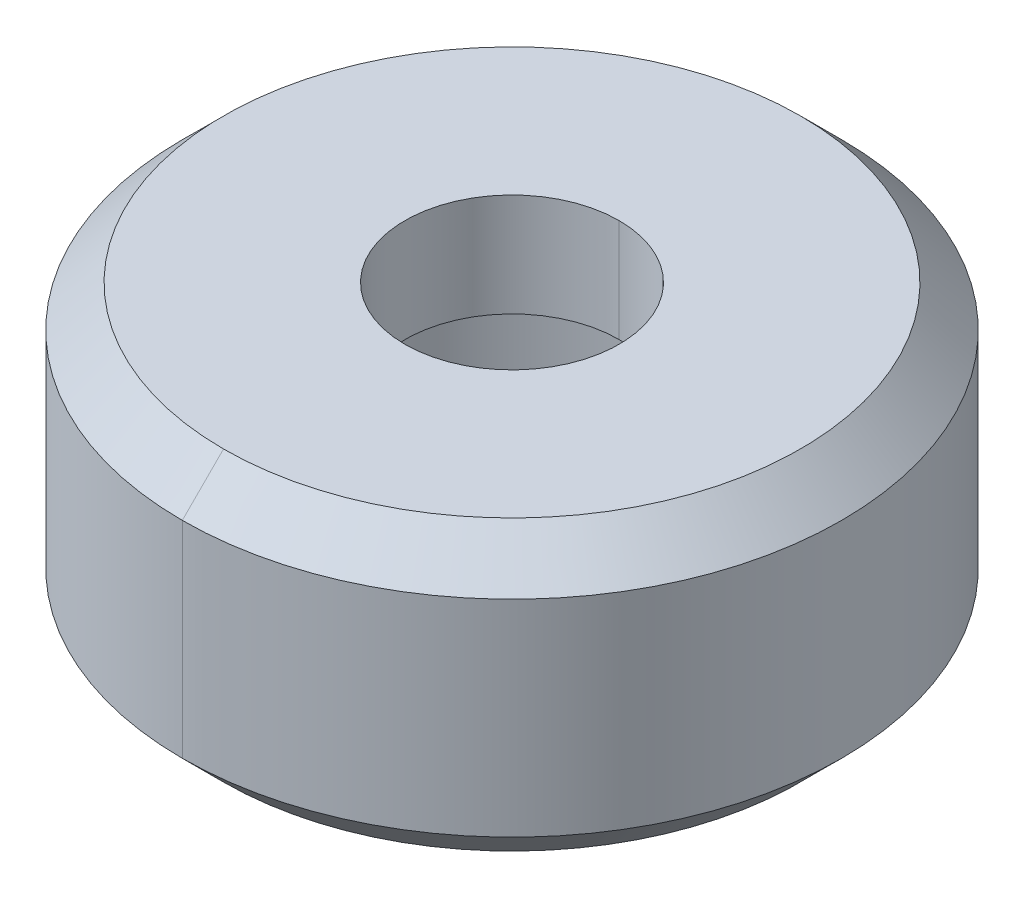
ISO-10303-21;
HEADER;
FILE_DESCRIPTION(('STEP AP214'),'2;1');
FILE_NAME('part.step','',(''),(''),'','','');
FILE_SCHEMA(('AUTOMOTIVE_DESIGN { 1 0 10303 214 1 1 1 1 }'));
ENDSEC;
DATA;
#1=APPLICATION_CONTEXT('core data for automotive mechanical design processes');
#2=APPLICATION_PROTOCOL_DEFINITION('international standard','automotive_design',2000,#1);
#3=PRODUCT_CONTEXT('',#1,'mechanical');
#4=PRODUCT('Part','Part','',(#3));
#5=PRODUCT_RELATED_PRODUCT_CATEGORY('part','',(#4));
#6=PRODUCT_DEFINITION_FORMATION('','',#4);
#7=PRODUCT_DEFINITION_CONTEXT('part definition',#1,'design');
#8=PRODUCT_DEFINITION('design','',#6,#7);
#9=PRODUCT_DEFINITION_SHAPE('','',#8);
#10=(LENGTH_UNIT() NAMED_UNIT(*) SI_UNIT(.MILLI.,.METRE.));
#11=(NAMED_UNIT(*) PLANE_ANGLE_UNIT() SI_UNIT($,.RADIAN.));
#12=(NAMED_UNIT(*) SI_UNIT($,.STERADIAN.) SOLID_ANGLE_UNIT());
#13=UNCERTAINTY_MEASURE_WITH_UNIT(LENGTH_MEASURE(1.E-05),#10,'distance_accuracy_value','');
#14=(GEOMETRIC_REPRESENTATION_CONTEXT(3) GLOBAL_UNCERTAINTY_ASSIGNED_CONTEXT((#13)) GLOBAL_UNIT_ASSIGNED_CONTEXT((#10,
#11,#12)) REPRESENTATION_CONTEXT('',''));
#15=CARTESIAN_POINT('',(0.,0.,0.));
#16=DIRECTION('',(0.,0.,1.));
#17=DIRECTION('',(1.,0.,0.));
#18=AXIS2_PLACEMENT_3D('',#15,#16,#17);
#19=CARTESIAN_POINT('',(0.,1.,0.));
#20=DIRECTION('',(0.,-1.,0.));
#21=DIRECTION('',(0.,0.,-1.));
#22=AXIS2_PLACEMENT_3D('',#19,#20,#21);
#23=CONICAL_SURFACE('',#22,5.05,0.785398163397448);
#24=DIRECTION('',(0.,-0.707106781186548,0.707106781186548));
#25=VECTOR('',#24,1.);
#26=CARTESIAN_POINT('',(0.,1.,5.05));
#27=LINE('',#26,#25);
#28=CARTESIAN_POINT('',(0.,1.,5.05));
#29=VERTEX_POINT('',#28);
#30=CARTESIAN_POINT('',(0.,0.,6.05));
#31=VERTEX_POINT('',#30);
#32=EDGE_CURVE('E131',#29,#31,#27,.T.);
#33=ORIENTED_EDGE('',*,*,#32,.F.);
#34=CARTESIAN_POINT('',(0.,1.,0.));
#35=DIRECTION('',(0.,-1.,0.));
#36=DIRECTION('',(0.,0.,1.));
#37=AXIS2_PLACEMENT_3D('',#34,#35,#36);
#38=CIRCLE('',#37,5.05);
#39=CARTESIAN_POINT('',(0.,1.,-5.05));
#40=VERTEX_POINT('',#39);
#41=EDGE_CURVE('E109',#40,#29,#38,.T.);
#42=ORIENTED_EDGE('',*,*,#41,.F.);
#43=DIRECTION('',(0.,-0.707106781186548,-0.707106781186548));
#44=VECTOR('',#43,1.);
#45=CARTESIAN_POINT('',(0.,1.,-5.05));
#46=LINE('',#45,#44);
#47=CARTESIAN_POINT('',(0.,0.,-6.05));
#48=VERTEX_POINT('',#47);
#49=EDGE_CURVE('E140',#40,#48,#46,.T.);
#50=ORIENTED_EDGE('',*,*,#49,.T.);
#51=CARTESIAN_POINT('',(0.,0.,0.));
#52=DIRECTION('',(0.,1.,0.));
#53=DIRECTION('',(0.,0.,1.));
#54=AXIS2_PLACEMENT_3D('',#51,#52,#53);
#55=CIRCLE('',#54,6.05);
#56=EDGE_CURVE('E132',#31,#48,#55,.T.);
#57=ORIENTED_EDGE('',*,*,#56,.F.);
#58=EDGE_LOOP('',(#33,#42,#50,#57));
#59=FACE_BOUND('',#58,.T.);
#60=ADVANCED_FACE('F16',(#59),#23,.F.);
#61=CARTESIAN_POINT('',(0.,0.,0.));
#62=DIRECTION('',(0.,1.,0.));
#63=DIRECTION('',(0.,0.,1.));
#64=AXIS2_PLACEMENT_3D('',#61,#62,#63);
#65=CONICAL_SURFACE('',#64,7.,0.785398163397446);
#66=DIRECTION('',(0.,0.707106781186549,-0.707106781186546));
#67=VECTOR('',#66,1.);
#68=CARTESIAN_POINT('',(0.,0.,-7.));
#69=LINE('',#68,#67);
#70=CARTESIAN_POINT('',(0.,0.,-7.));
#71=VERTEX_POINT('',#70);
#72=CARTESIAN_POINT('',(0.,1.,-8.));
#73=VERTEX_POINT('',#72);
#74=EDGE_CURVE('E160',#71,#73,#69,.T.);
#75=ORIENTED_EDGE('',*,*,#74,.F.);
#76=CARTESIAN_POINT('',(0.,0.,0.));
#77=DIRECTION('',(0.,-1.,0.));
#78=DIRECTION('',(0.,0.,1.));
#79=AXIS2_PLACEMENT_3D('',#76,#77,#78);
#80=CIRCLE('',#79,7.);
#81=CARTESIAN_POINT('',(0.,0.,7.));
#82=VERTEX_POINT('',#81);
#83=EDGE_CURVE('E120',#82,#71,#80,.T.);
#84=ORIENTED_EDGE('',*,*,#83,.F.);
#85=DIRECTION('',(0.,0.707106781186549,0.707106781186546));
#86=VECTOR('',#85,1.);
#87=CARTESIAN_POINT('',(0.,0.,7.));
#88=LINE('',#87,#86);
#89=CARTESIAN_POINT('',(0.,1.,8.));
#90=VERTEX_POINT('',#89);
#91=EDGE_CURVE('E159',#82,#90,#88,.T.);
#92=ORIENTED_EDGE('',*,*,#91,.T.);
#93=CARTESIAN_POINT('',(0.,1.,0.));
#94=DIRECTION('',(0.,1.,0.));
#95=DIRECTION('',(0.,0.,1.));
#96=AXIS2_PLACEMENT_3D('',#93,#94,#95);
#97=CIRCLE('',#96,8.);
#98=EDGE_CURVE('E219',#73,#90,#97,.T.);
#99=ORIENTED_EDGE('',*,*,#98,.F.);
#100=EDGE_LOOP('',(#75,#84,#92,#99));
#101=FACE_BOUND('',#100,.T.);
#102=ADVANCED_FACE('F249',(#101),#65,.T.);
#103=CARTESIAN_POINT('',(0.,6.,0.));
#104=DIRECTION('',(0.,-1.,0.));
#105=DIRECTION('',(0.,0.,-1.));
#106=AXIS2_PLACEMENT_3D('',#103,#104,#105);
#107=CONICAL_SURFACE('',#106,8.,0.785398163397449);
#108=DIRECTION('',(0.,-0.707106781186547,0.707106781186548));
#109=VECTOR('',#108,1.);
#110=CARTESIAN_POINT('',(0.,6.,8.));
#111=LINE('',#110,#109);
#112=CARTESIAN_POINT('',(0.,7.,7.));
#113=VERTEX_POINT('',#112);
#114=CARTESIAN_POINT('',(0.,6.,8.));
#115=VERTEX_POINT('',#114);
#116=EDGE_CURVE('E154',#113,#115,#111,.T.);
#117=ORIENTED_EDGE('',*,*,#116,.F.);
#118=CARTESIAN_POINT('',(0.,7.,0.));
#119=DIRECTION('',(0.,1.,0.));
#120=DIRECTION('',(0.,0.,-1.));
#121=AXIS2_PLACEMENT_3D('',#118,#119,#120);
#122=CIRCLE('',#121,7.);
#123=CARTESIAN_POINT('',(0.,7.,-7.));
#124=VERTEX_POINT('',#123);
#125=EDGE_CURVE('E222',#124,#113,#122,.T.);
#126=ORIENTED_EDGE('',*,*,#125,.F.);
#127=DIRECTION('',(0.,-0.707106781186547,-0.707106781186548));
#128=VECTOR('',#127,1.);
#129=CARTESIAN_POINT('',(0.,6.,-8.));
#130=LINE('',#129,#128);
#131=CARTESIAN_POINT('',(0.,6.,-8.));
#132=VERTEX_POINT('',#131);
#133=EDGE_CURVE('E153',#124,#132,#130,.T.);
#134=ORIENTED_EDGE('',*,*,#133,.T.);
#135=CARTESIAN_POINT('',(0.,6.,0.));
#136=DIRECTION('',(0.,-1.,0.));
#137=DIRECTION('',(0.,0.,-1.));
#138=AXIS2_PLACEMENT_3D('',#135,#136,#137);
#139=CIRCLE('',#138,8.);
#140=EDGE_CURVE('E147',#115,#132,#139,.T.);
#141=ORIENTED_EDGE('',*,*,#140,.F.);
#142=EDGE_LOOP('',(#117,#126,#134,#141));
#143=FACE_BOUND('',#142,.T.);
#144=ADVANCED_FACE('F241',(#143),#107,.T.);
#145=CARTESIAN_POINT('',(-2.6,4.5,0.));
#146=DIRECTION('',(0.,1.,0.));
#147=DIRECTION('',(1.,0.,0.));
#148=AXIS2_PLACEMENT_3D('',#145,#146,#147);
#149=PLANE('',#148);
#150=CARTESIAN_POINT('',(0.,4.5,0.));
#151=DIRECTION('',(0.,-1.,0.));
#152=DIRECTION('',(0.,0.,-1.));
#153=AXIS2_PLACEMENT_3D('',#150,#151,#152);
#154=CIRCLE('',#153,2.6);
#155=CARTESIAN_POINT('',(0.,4.5,-2.6));
#156=VERTEX_POINT('',#155);
#157=CARTESIAN_POINT('',(0.,4.5,2.6));
#158=VERTEX_POINT('',#157);
#159=EDGE_CURVE('E10',#156,#158,#154,.T.);
#160=ORIENTED_EDGE('',*,*,#159,.F.);
#161=CARTESIAN_POINT('',(0.,4.5,0.));
#162=DIRECTION('',(0.,-1.,0.));
#163=DIRECTION('',(0.,0.,-1.));
#164=AXIS2_PLACEMENT_3D('',#161,#162,#163);
#165=CIRCLE('',#164,2.6);
#166=EDGE_CURVE('E180',#158,#156,#165,.T.);
#167=ORIENTED_EDGE('',*,*,#166,.F.);
#168=EDGE_LOOP('',(#160,#167));
#169=FACE_BOUND('',#168,.T.);
#170=CARTESIAN_POINT('',(0.,4.5,0.));
#171=DIRECTION('',(0.,-1.,0.));
#172=DIRECTION('',(0.,0.,-1.));
#173=AXIS2_PLACEMENT_3D('',#170,#171,#172);
#174=CIRCLE('',#173,5.05);
#175=CARTESIAN_POINT('',(0.,4.5,-5.05));
#176=VERTEX_POINT('',#175);
#177=CARTESIAN_POINT('',(0.,4.5,5.05));
#178=VERTEX_POINT('',#177);
#179=EDGE_CURVE('E37',#176,#178,#174,.T.);
#180=ORIENTED_EDGE('',*,*,#179,.T.);
#181=CARTESIAN_POINT('',(0.,4.5,0.));
#182=DIRECTION('',(0.,-1.,0.));
#183=DIRECTION('',(0.,0.,-1.));
#184=AXIS2_PLACEMENT_3D('',#181,#182,#183);
#185=CIRCLE('',#184,5.05);
#186=EDGE_CURVE('E127',#178,#176,#185,.T.);
#187=ORIENTED_EDGE('',*,*,#186,.T.);
#188=EDGE_LOOP('',(#180,#187));
#189=FACE_BOUND('',#188,.T.);
#190=ADVANCED_FACE('F239',(#169,#189),#149,.F.);
#191=CARTESIAN_POINT('',(0.,0.,0.));
#192=DIRECTION('',(0.,-1.,0.));
#193=DIRECTION('',(0.,0.,-1.));
#194=AXIS2_PLACEMENT_3D('',#191,#192,#193);
#195=CYLINDRICAL_SURFACE('',#194,2.6);
#196=DIRECTION('',(0.,-1.,0.));
#197=VECTOR('',#196,1.);
#198=CARTESIAN_POINT('',(0.,0.,2.6));
#199=LINE('',#198,#197);
#200=CARTESIAN_POINT('',(0.,7.,2.6));
#201=VERTEX_POINT('',#200);
#202=EDGE_CURVE('E185',#201,#158,#199,.T.);
#203=ORIENTED_EDGE('',*,*,#202,.F.);
#204=CARTESIAN_POINT('',(0.,7.,0.));
#205=DIRECTION('',(0.,-1.,0.));
#206=DIRECTION('',(0.,0.,-1.));
#207=AXIS2_PLACEMENT_3D('',#204,#205,#206);
#208=CIRCLE('',#207,2.6);
#209=CARTESIAN_POINT('',(0.,7.,-2.6));
#210=VERTEX_POINT('',#209);
#211=EDGE_CURVE('E24',#210,#201,#208,.T.);
#212=ORIENTED_EDGE('',*,*,#211,.F.);
#213=DIRECTION('',(0.,-1.,0.));
#214=VECTOR('',#213,1.);
#215=CARTESIAN_POINT('',(0.,0.,-2.6));
#216=LINE('',#215,#214);
#217=EDGE_CURVE('E184',#210,#156,#216,.T.);
#218=ORIENTED_EDGE('',*,*,#217,.T.);
#219=ORIENTED_EDGE('',*,*,#159,.T.);
#220=EDGE_LOOP('',(#203,#212,#218,#219));
#221=FACE_BOUND('',#220,.T.);
#222=ADVANCED_FACE('F234',(#221),#195,.F.);
#223=CARTESIAN_POINT('',(-8.,7.,0.));
#224=DIRECTION('',(0.,-1.,0.));
#225=DIRECTION('',(0.,0.,-1.));
#226=AXIS2_PLACEMENT_3D('',#223,#224,#225);
#227=PLANE('',#226);
#228=ORIENTED_EDGE('',*,*,#211,.T.);
#229=CARTESIAN_POINT('',(0.,7.,0.));
#230=DIRECTION('',(0.,-1.,0.));
#231=DIRECTION('',(0.,0.,-1.));
#232=AXIS2_PLACEMENT_3D('',#229,#230,#231);
#233=CIRCLE('',#232,2.6);
#234=EDGE_CURVE('E169',#201,#210,#233,.T.);
#235=ORIENTED_EDGE('',*,*,#234,.T.);
#236=EDGE_LOOP('',(#228,#235));
#237=FACE_BOUND('',#236,.T.);
#238=ORIENTED_EDGE('',*,*,#125,.T.);
#239=CARTESIAN_POINT('',(0.,7.,0.));
#240=DIRECTION('',(0.,1.,0.));
#241=DIRECTION('',(0.,0.,-1.));
#242=AXIS2_PLACEMENT_3D('',#239,#240,#241);
#243=CIRCLE('',#242,7.);
#244=EDGE_CURVE('E173',#113,#124,#243,.T.);
#245=ORIENTED_EDGE('',*,*,#244,.T.);
#246=EDGE_LOOP('',(#238,#245));
#247=FACE_BOUND('',#246,.T.);
#248=ADVANCED_FACE('F229',(#237,#247),#227,.F.);
#249=CARTESIAN_POINT('',(0.,0.,0.));
#250=DIRECTION('',(0.,-1.,0.));
#251=DIRECTION('',(0.,0.,-1.));
#252=AXIS2_PLACEMENT_3D('',#249,#250,#251);
#253=CYLINDRICAL_SURFACE('',#252,8.);
#254=DIRECTION('',(0.,-1.,0.));
#255=VECTOR('',#254,1.);
#256=CARTESIAN_POINT('',(0.,0.,8.));
#257=LINE('',#256,#255);
#258=EDGE_CURVE('E201',#115,#90,#257,.T.);
#259=ORIENTED_EDGE('',*,*,#258,.F.);
#260=ORIENTED_EDGE('',*,*,#140,.T.);
#261=DIRECTION('',(0.,-1.,0.));
#262=VECTOR('',#261,1.);
#263=CARTESIAN_POINT('',(0.,0.,-8.));
#264=LINE('',#263,#262);
#265=EDGE_CURVE('E205',#132,#73,#264,.T.);
#266=ORIENTED_EDGE('',*,*,#265,.T.);
#267=ORIENTED_EDGE('',*,*,#98,.T.);
#268=EDGE_LOOP('',(#259,#260,#266,#267));
#269=FACE_BOUND('',#268,.T.);
#270=ADVANCED_FACE('F264',(#269),#253,.T.);
#271=CARTESIAN_POINT('',(-5.05,0.,0.));
#272=DIRECTION('',(0.,1.,0.));
#273=DIRECTION('',(1.,0.,0.));
#274=AXIS2_PLACEMENT_3D('',#271,#272,#273);
#275=PLANE('',#274);
#276=CARTESIAN_POINT('',(0.,0.,0.));
#277=DIRECTION('',(0.,1.,0.));
#278=DIRECTION('',(0.,0.,1.));
#279=AXIS2_PLACEMENT_3D('',#276,#277,#278);
#280=CIRCLE('',#279,6.05);
#281=EDGE_CURVE('E137',#48,#31,#280,.T.);
#282=ORIENTED_EDGE('',*,*,#281,.T.);
#283=ORIENTED_EDGE('',*,*,#56,.T.);
#284=EDGE_LOOP('',(#282,#283));
#285=FACE_BOUND('',#284,.T.);
#286=ORIENTED_EDGE('',*,*,#83,.T.);
#287=CARTESIAN_POINT('',(0.,0.,0.));
#288=DIRECTION('',(0.,-1.,0.));
#289=DIRECTION('',(0.,0.,1.));
#290=AXIS2_PLACEMENT_3D('',#287,#288,#289);
#291=CIRCLE('',#290,7.);
#292=EDGE_CURVE('E165',#71,#82,#291,.T.);
#293=ORIENTED_EDGE('',*,*,#292,.T.);
#294=EDGE_LOOP('',(#286,#293));
#295=FACE_BOUND('',#294,.T.);
#296=ADVANCED_FACE('F262',(#285,#295),#275,.F.);
#297=CARTESIAN_POINT('',(0.,0.,0.));
#298=DIRECTION('',(0.,-1.,0.));
#299=DIRECTION('',(0.,0.,-1.));
#300=AXIS2_PLACEMENT_3D('',#297,#298,#299);
#301=CYLINDRICAL_SURFACE('',#300,5.05);
#302=DIRECTION('',(0.,-1.,0.));
#303=VECTOR('',#302,1.);
#304=CARTESIAN_POINT('',(0.,0.,5.05));
#305=LINE('',#304,#303);
#306=EDGE_CURVE('E112',#178,#29,#305,.T.);
#307=ORIENTED_EDGE('',*,*,#306,.F.);
#308=ORIENTED_EDGE('',*,*,#179,.F.);
#309=DIRECTION('',(0.,-1.,0.));
#310=VECTOR('',#309,1.);
#311=CARTESIAN_POINT('',(0.,0.,-5.05));
#312=LINE('',#311,#310);
#313=EDGE_CURVE('E114',#176,#40,#312,.T.);
#314=ORIENTED_EDGE('',*,*,#313,.T.);
#315=ORIENTED_EDGE('',*,*,#41,.T.);
#316=EDGE_LOOP('',(#307,#308,#314,#315));
#317=FACE_BOUND('',#316,.T.);
#318=ADVANCED_FACE('F111',(#317),#301,.F.);
#319=CARTESIAN_POINT('',(0.,0.,0.));
#320=DIRECTION('',(0.,-1.,0.));
#321=DIRECTION('',(0.,0.,-1.));
#322=AXIS2_PLACEMENT_3D('',#319,#320,#321);
#323=CYLINDRICAL_SURFACE('',#322,5.05);
#324=ORIENTED_EDGE('',*,*,#186,.F.);
#325=ORIENTED_EDGE('',*,*,#306,.T.);
#326=CARTESIAN_POINT('',(0.,1.,0.));
#327=DIRECTION('',(0.,-1.,0.));
#328=DIRECTION('',(0.,0.,1.));
#329=AXIS2_PLACEMENT_3D('',#326,#327,#328);
#330=CIRCLE('',#329,5.05);
#331=EDGE_CURVE('E126',#29,#40,#330,.T.);
#332=ORIENTED_EDGE('',*,*,#331,.T.);
#333=ORIENTED_EDGE('',*,*,#313,.F.);
#334=EDGE_LOOP('',(#324,#325,#332,#333));
#335=FACE_BOUND('',#334,.T.);
#336=ADVANCED_FACE('F124',(#335),#323,.F.);
#337=CARTESIAN_POINT('',(0.,0.,0.));
#338=DIRECTION('',(0.,-1.,0.));
#339=DIRECTION('',(0.,0.,-1.));
#340=AXIS2_PLACEMENT_3D('',#337,#338,#339);
#341=CYLINDRICAL_SURFACE('',#340,8.);
#342=CARTESIAN_POINT('',(0.,6.,0.));
#343=DIRECTION('',(0.,-1.,0.));
#344=DIRECTION('',(0.,0.,-1.));
#345=AXIS2_PLACEMENT_3D('',#342,#343,#344);
#346=CIRCLE('',#345,8.);
#347=EDGE_CURVE('E149',#132,#115,#346,.T.);
#348=ORIENTED_EDGE('',*,*,#347,.T.);
#349=ORIENTED_EDGE('',*,*,#258,.T.);
#350=CARTESIAN_POINT('',(0.,1.,0.));
#351=DIRECTION('',(0.,1.,0.));
#352=DIRECTION('',(0.,0.,1.));
#353=AXIS2_PLACEMENT_3D('',#350,#351,#352);
#354=CIRCLE('',#353,8.);
#355=EDGE_CURVE('E155',#90,#73,#354,.T.);
#356=ORIENTED_EDGE('',*,*,#355,.T.);
#357=ORIENTED_EDGE('',*,*,#265,.F.);
#358=EDGE_LOOP('',(#348,#349,#356,#357));
#359=FACE_BOUND('',#358,.T.);
#360=ADVANCED_FACE('F277',(#359),#341,.T.);
#361=CARTESIAN_POINT('',(0.,0.,0.));
#362=DIRECTION('',(0.,-1.,0.));
#363=DIRECTION('',(0.,0.,-1.));
#364=AXIS2_PLACEMENT_3D('',#361,#362,#363);
#365=CYLINDRICAL_SURFACE('',#364,2.6);
#366=ORIENTED_EDGE('',*,*,#234,.F.);
#367=ORIENTED_EDGE('',*,*,#202,.T.);
#368=ORIENTED_EDGE('',*,*,#166,.T.);
#369=ORIENTED_EDGE('',*,*,#217,.F.);
#370=EDGE_LOOP('',(#366,#367,#368,#369));
#371=FACE_BOUND('',#370,.T.);
#372=ADVANCED_FACE('F237',(#371),#365,.F.);
#373=CARTESIAN_POINT('',(0.,6.,0.));
#374=DIRECTION('',(0.,-1.,0.));
#375=DIRECTION('',(0.,0.,-1.));
#376=AXIS2_PLACEMENT_3D('',#373,#374,#375);
#377=CONICAL_SURFACE('',#376,8.,0.785398163397449);
#378=ORIENTED_EDGE('',*,*,#244,.F.);
#379=ORIENTED_EDGE('',*,*,#116,.T.);
#380=ORIENTED_EDGE('',*,*,#347,.F.);
#381=ORIENTED_EDGE('',*,*,#133,.F.);
#382=EDGE_LOOP('',(#378,#379,#380,#381));
#383=FACE_BOUND('',#382,.T.);
#384=ADVANCED_FACE('F282',(#383),#377,.T.);
#385=CARTESIAN_POINT('',(0.,0.,0.));
#386=DIRECTION('',(0.,1.,0.));
#387=DIRECTION('',(0.,0.,1.));
#388=AXIS2_PLACEMENT_3D('',#385,#386,#387);
#389=CONICAL_SURFACE('',#388,7.,0.785398163397446);
#390=ORIENTED_EDGE('',*,*,#292,.F.);
#391=ORIENTED_EDGE('',*,*,#74,.T.);
#392=ORIENTED_EDGE('',*,*,#355,.F.);
#393=ORIENTED_EDGE('',*,*,#91,.F.);
#394=EDGE_LOOP('',(#390,#391,#392,#393));
#395=FACE_BOUND('',#394,.T.);
#396=ADVANCED_FACE('F284',(#395),#389,.T.);
#397=CARTESIAN_POINT('',(0.,1.,0.));
#398=DIRECTION('',(0.,-1.,0.));
#399=DIRECTION('',(0.,0.,-1.));
#400=AXIS2_PLACEMENT_3D('',#397,#398,#399);
#401=CONICAL_SURFACE('',#400,5.05,0.785398163397448);
#402=ORIENTED_EDGE('',*,*,#331,.F.);
#403=ORIENTED_EDGE('',*,*,#32,.T.);
#404=ORIENTED_EDGE('',*,*,#281,.F.);
#405=ORIENTED_EDGE('',*,*,#49,.F.);
#406=EDGE_LOOP('',(#402,#403,#404,#405));
#407=FACE_BOUND('',#406,.T.);
#408=ADVANCED_FACE('F139',(#407),#401,.F.);
#409=CLOSED_SHELL('',(#60,#102,#144,#190,#222,#248,#270,#296,#318,#336,#360,#372,#384,#396,#408));
#410=MANIFOLD_SOLID_BREP('B1',#409);
#411=ADVANCED_BREP_SHAPE_REPRESENTATION('',(#18,#410),#14);
#412=SHAPE_DEFINITION_REPRESENTATION(#9,#411);
ENDSEC;
END-ISO-10303-21;
